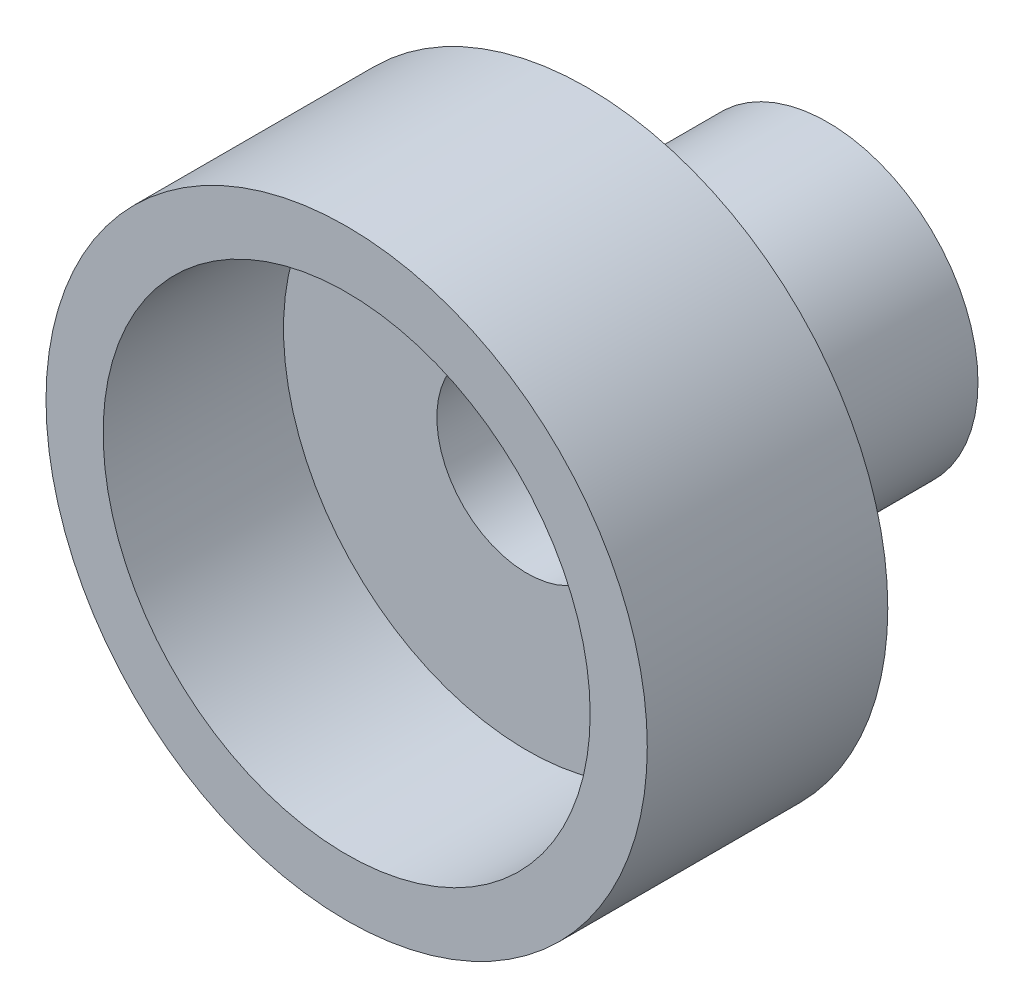
ISO-10303-21;
HEADER;
FILE_DESCRIPTION(('STEP AP214'),'2;1');
FILE_NAME('part.step','',(''),(''),'','','');
FILE_SCHEMA(('AUTOMOTIVE_DESIGN { 1 0 10303 214 1 1 1 1 }'));
ENDSEC;
DATA;
#1=APPLICATION_CONTEXT('core data for automotive mechanical design processes');
#2=APPLICATION_PROTOCOL_DEFINITION('international standard','automotive_design',2000,#1);
#3=PRODUCT_CONTEXT('',#1,'mechanical');
#4=PRODUCT('Part','Part','',(#3));
#5=PRODUCT_RELATED_PRODUCT_CATEGORY('part','',(#4));
#6=PRODUCT_DEFINITION_FORMATION('','',#4);
#7=PRODUCT_DEFINITION_CONTEXT('part definition',#1,'design');
#8=PRODUCT_DEFINITION('design','',#6,#7);
#9=PRODUCT_DEFINITION_SHAPE('','',#8);
#10=(LENGTH_UNIT() NAMED_UNIT(*) SI_UNIT(.MILLI.,.METRE.));
#11=(NAMED_UNIT(*) PLANE_ANGLE_UNIT() SI_UNIT($,.RADIAN.));
#12=(NAMED_UNIT(*) SI_UNIT($,.STERADIAN.) SOLID_ANGLE_UNIT());
#13=UNCERTAINTY_MEASURE_WITH_UNIT(LENGTH_MEASURE(1.E-05),#10,'distance_accuracy_value','');
#14=(GEOMETRIC_REPRESENTATION_CONTEXT(3) GLOBAL_UNCERTAINTY_ASSIGNED_CONTEXT((#13)) GLOBAL_UNIT_ASSIGNED_CONTEXT((#10,
#11,#12)) REPRESENTATION_CONTEXT('',''));
#15=CARTESIAN_POINT('',(0.,0.,0.));
#16=DIRECTION('',(0.,0.,1.));
#17=DIRECTION('',(1.,0.,0.));
#18=AXIS2_PLACEMENT_3D('',#15,#16,#17);
#19=CARTESIAN_POINT('',(0.,0.,-8.24264068711929));
#20=DIRECTION('',(0.,0.,1.));
#21=DIRECTION('',(1.,0.,0.));
#22=AXIS2_PLACEMENT_3D('',#19,#20,#21);
#23=CYLINDRICAL_SURFACE('',#22,1.5);
#24=CARTESIAN_POINT('',(0.,0.,-4.));
#25=DIRECTION('',(0.,0.,-1.));
#26=DIRECTION('',(-1.,0.,0.));
#27=AXIS2_PLACEMENT_3D('',#24,#25,#26);
#28=CIRCLE('',#27,1.5);
#29=CARTESIAN_POINT('',(-1.5,0.,-4.));
#30=VERTEX_POINT('',#29);
#31=EDGE_CURVE('E53',#30,#30,#28,.T.);
#32=ORIENTED_EDGE('',*,*,#31,.T.);
#33=EDGE_LOOP('',(#32));
#34=FACE_BOUND('',#33,.T.);
#35=CARTESIAN_POINT('',(0.,0.,0.999999999999999));
#36=DIRECTION('',(0.,0.,1.));
#37=DIRECTION('',(1.,0.,0.));
#38=AXIS2_PLACEMENT_3D('',#35,#36,#37);
#39=CIRCLE('',#38,1.5);
#40=CARTESIAN_POINT('',(1.5,0.,0.999999999999999));
#41=VERTEX_POINT('',#40);
#42=EDGE_CURVE('E35',#41,#41,#39,.T.);
#43=ORIENTED_EDGE('',*,*,#42,.T.);
#44=EDGE_LOOP('',(#43));
#45=FACE_BOUND('',#44,.T.);
#46=ADVANCED_FACE('F31',(#34,#45),#23,.F.);
#47=CARTESIAN_POINT('',(0.,0.,4.));
#48=DIRECTION('',(0.,0.,-1.));
#49=DIRECTION('',(-1.,0.,0.));
#50=AXIS2_PLACEMENT_3D('',#47,#48,#49);
#51=CYLINDRICAL_SURFACE('',#50,5.);
#52=CARTESIAN_POINT('',(0.,0.,4.));
#53=DIRECTION('',(0.,0.,1.));
#54=DIRECTION('',(1.,0.,0.));
#55=AXIS2_PLACEMENT_3D('',#52,#53,#54);
#56=CIRCLE('',#55,5.);
#57=CARTESIAN_POINT('',(5.,0.,4.));
#58=VERTEX_POINT('',#57);
#59=EDGE_CURVE('E39',#58,#58,#56,.T.);
#60=ORIENTED_EDGE('',*,*,#59,.F.);
#61=EDGE_LOOP('',(#60));
#62=FACE_BOUND('',#61,.T.);
#63=CARTESIAN_POINT('',(0.,0.,0.));
#64=DIRECTION('',(0.,0.,1.));
#65=DIRECTION('',(1.,0.,0.));
#66=AXIS2_PLACEMENT_3D('',#63,#64,#65);
#67=CIRCLE('',#66,5.);
#68=CARTESIAN_POINT('',(5.,0.,0.));
#69=VERTEX_POINT('',#68);
#70=EDGE_CURVE('E44',#69,#69,#67,.T.);
#71=ORIENTED_EDGE('',*,*,#70,.T.);
#72=EDGE_LOOP('',(#71));
#73=FACE_BOUND('',#72,.T.);
#74=ADVANCED_FACE('F33',(#62,#73),#51,.T.);
#75=CARTESIAN_POINT('',(0.,0.,4.));
#76=DIRECTION('',(0.,0.,1.));
#77=DIRECTION('',(1.,0.,0.));
#78=AXIS2_PLACEMENT_3D('',#75,#76,#77);
#79=PLANE('',#78);
#80=CARTESIAN_POINT('',(0.,0.,4.));
#81=DIRECTION('',(0.,0.,1.));
#82=DIRECTION('',(1.,0.,0.));
#83=AXIS2_PLACEMENT_3D('',#80,#81,#82);
#84=CIRCLE('',#83,4.05);
#85=CARTESIAN_POINT('',(4.05,0.,4.));
#86=VERTEX_POINT('',#85);
#87=EDGE_CURVE('E62',#86,#86,#84,.T.);
#88=ORIENTED_EDGE('',*,*,#87,.F.);
#89=EDGE_LOOP('',(#88));
#90=FACE_BOUND('',#89,.T.);
#91=ORIENTED_EDGE('',*,*,#59,.T.);
#92=EDGE_LOOP('',(#91));
#93=FACE_BOUND('',#92,.T.);
#94=ADVANCED_FACE('F77',(#90,#93),#79,.T.);
#95=CARTESIAN_POINT('',(0.,0.,0.));
#96=DIRECTION('',(0.,0.,1.));
#97=DIRECTION('',(1.,0.,0.));
#98=AXIS2_PLACEMENT_3D('',#95,#96,#97);
#99=PLANE('',#98);
#100=CARTESIAN_POINT('',(0.,0.,0.));
#101=DIRECTION('',(0.,0.,-1.));
#102=DIRECTION('',(-1.,0.,0.));
#103=AXIS2_PLACEMENT_3D('',#100,#101,#102);
#104=CIRCLE('',#103,2.5);
#105=CARTESIAN_POINT('',(-2.5,0.,0.));
#106=VERTEX_POINT('',#105);
#107=EDGE_CURVE('E10',#106,#106,#104,.T.);
#108=ORIENTED_EDGE('',*,*,#107,.F.);
#109=EDGE_LOOP('',(#108));
#110=FACE_BOUND('',#109,.T.);
#111=ORIENTED_EDGE('',*,*,#70,.F.);
#112=EDGE_LOOP('',(#111));
#113=FACE_BOUND('',#112,.T.);
#114=ADVANCED_FACE('F80',(#110,#113),#99,.F.);
#115=CARTESIAN_POINT('',(0.,0.,-4.));
#116=DIRECTION('',(0.,0.,1.));
#117=DIRECTION('',(1.,0.,0.));
#118=AXIS2_PLACEMENT_3D('',#115,#116,#117);
#119=CYLINDRICAL_SURFACE('',#118,2.5);
#120=CARTESIAN_POINT('',(0.,0.,-4.));
#121=DIRECTION('',(0.,0.,-1.));
#122=DIRECTION('',(-1.,0.,0.));
#123=AXIS2_PLACEMENT_3D('',#120,#121,#122);
#124=CIRCLE('',#123,2.5);
#125=CARTESIAN_POINT('',(-2.5,0.,-4.));
#126=VERTEX_POINT('',#125);
#127=EDGE_CURVE('E47',#126,#126,#124,.T.);
#128=ORIENTED_EDGE('',*,*,#127,.F.);
#129=EDGE_LOOP('',(#128));
#130=FACE_BOUND('',#129,.T.);
#131=ORIENTED_EDGE('',*,*,#107,.T.);
#132=EDGE_LOOP('',(#131));
#133=FACE_BOUND('',#132,.T.);
#134=ADVANCED_FACE('F96',(#130,#133),#119,.T.);
#135=CARTESIAN_POINT('',(0.,0.,-4.));
#136=DIRECTION('',(0.,0.,-1.));
#137=DIRECTION('',(-1.,0.,0.));
#138=AXIS2_PLACEMENT_3D('',#135,#136,#137);
#139=PLANE('',#138);
#140=ORIENTED_EDGE('',*,*,#31,.F.);
#141=EDGE_LOOP('',(#140));
#142=FACE_BOUND('',#141,.T.);
#143=ORIENTED_EDGE('',*,*,#127,.T.);
#144=EDGE_LOOP('',(#143));
#145=FACE_BOUND('',#144,.T.);
#146=ADVANCED_FACE('F73',(#142,#145),#139,.T.);
#147=CARTESIAN_POINT('',(0.,0.,1.));
#148=DIRECTION('',(0.,0.,1.));
#149=DIRECTION('',(1.,0.,0.));
#150=AXIS2_PLACEMENT_3D('',#147,#148,#149);
#151=CYLINDRICAL_SURFACE('',#150,4.05);
#152=CARTESIAN_POINT('',(0.,0.,1.));
#153=DIRECTION('',(0.,0.,1.));
#154=DIRECTION('',(1.,0.,0.));
#155=AXIS2_PLACEMENT_3D('',#152,#153,#154);
#156=CIRCLE('',#155,4.05);
#157=CARTESIAN_POINT('',(4.05,0.,1.));
#158=VERTEX_POINT('',#157);
#159=EDGE_CURVE('E60',#158,#158,#156,.T.);
#160=ORIENTED_EDGE('',*,*,#159,.F.);
#161=EDGE_LOOP('',(#160));
#162=FACE_BOUND('',#161,.T.);
#163=ORIENTED_EDGE('',*,*,#87,.T.);
#164=EDGE_LOOP('',(#163));
#165=FACE_BOUND('',#164,.T.);
#166=ADVANCED_FACE('F70',(#162,#165),#151,.F.);
#167=CARTESIAN_POINT('',(0.,0.,1.));
#168=DIRECTION('',(0.,0.,1.));
#169=DIRECTION('',(1.,0.,0.));
#170=AXIS2_PLACEMENT_3D('',#167,#168,#169);
#171=PLANE('',#170);
#172=ORIENTED_EDGE('',*,*,#42,.F.);
#173=EDGE_LOOP('',(#172));
#174=FACE_BOUND('',#173,.T.);
#175=ORIENTED_EDGE('',*,*,#159,.T.);
#176=EDGE_LOOP('',(#175));
#177=FACE_BOUND('',#176,.T.);
#178=ADVANCED_FACE('F68',(#174,#177),#171,.T.);
#179=CLOSED_SHELL('',(#46,#74,#94,#114,#134,#146,#166,#178));
#180=MANIFOLD_SOLID_BREP('B2',#179);
#181=ADVANCED_BREP_SHAPE_REPRESENTATION('',(#18,#180),#14);
#182=SHAPE_DEFINITION_REPRESENTATION(#9,#181);
ENDSEC;
END-ISO-10303-21;
